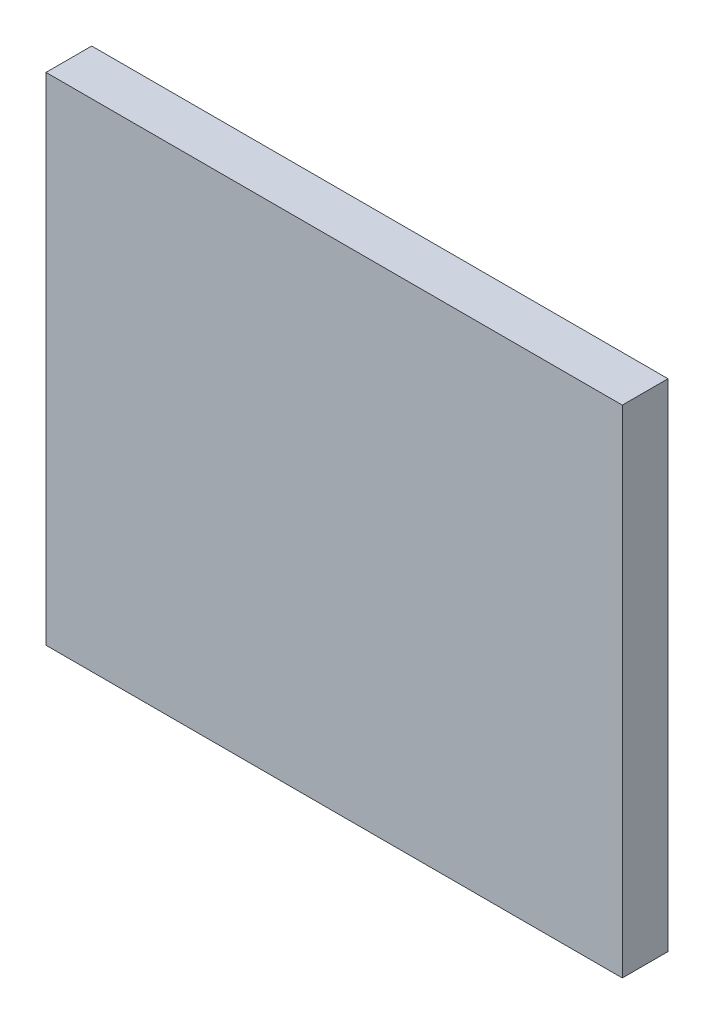
ISO-10303-21;
HEADER;
FILE_DESCRIPTION(('STEP AP214'),'2;1');
FILE_NAME('part.step','',(''),(''),'','','');
FILE_SCHEMA(('AUTOMOTIVE_DESIGN { 1 0 10303 214 1 1 1 1 }'));
ENDSEC;
DATA;
#1=APPLICATION_CONTEXT('core data for automotive mechanical design processes');
#2=APPLICATION_PROTOCOL_DEFINITION('international standard','automotive_design',2000,#1);
#3=PRODUCT_CONTEXT('',#1,'mechanical');
#4=PRODUCT('Part','Part','',(#3));
#5=PRODUCT_RELATED_PRODUCT_CATEGORY('part','',(#4));
#6=PRODUCT_DEFINITION_FORMATION('','',#4);
#7=PRODUCT_DEFINITION_CONTEXT('part definition',#1,'design');
#8=PRODUCT_DEFINITION('design','',#6,#7);
#9=PRODUCT_DEFINITION_SHAPE('','',#8);
#10=(LENGTH_UNIT() NAMED_UNIT(*) SI_UNIT(.MILLI.,.METRE.));
#11=(NAMED_UNIT(*) PLANE_ANGLE_UNIT() SI_UNIT($,.RADIAN.));
#12=(NAMED_UNIT(*) SI_UNIT($,.STERADIAN.) SOLID_ANGLE_UNIT());
#13=UNCERTAINTY_MEASURE_WITH_UNIT(LENGTH_MEASURE(1.E-05),#10,'distance_accuracy_value','');
#14=(GEOMETRIC_REPRESENTATION_CONTEXT(3) GLOBAL_UNCERTAINTY_ASSIGNED_CONTEXT((#13)) GLOBAL_UNIT_ASSIGNED_CONTEXT((#10,
#11,#12)) REPRESENTATION_CONTEXT('',''));
#15=CARTESIAN_POINT('',(0.,0.,0.));
#16=DIRECTION('',(0.,0.,1.));
#17=DIRECTION('',(1.,0.,0.));
#18=AXIS2_PLACEMENT_3D('',#15,#16,#17);
#19=CARTESIAN_POINT('',(0.,0.,44.45));
#20=DIRECTION('',(1.,0.,0.));
#21=DIRECTION('',(0.,1.,0.));
#22=AXIS2_PLACEMENT_3D('',#19,#20,#21);
#23=PLANE('',#22);
#24=DIRECTION('',(0.,-1.,0.));
#25=VECTOR('',#24,1.);
#26=CARTESIAN_POINT('',(0.,0.,0.));
#27=LINE('',#26,#25);
#28=CARTESIAN_POINT('',(0.,0.,0.));
#29=VERTEX_POINT('',#28);
#30=CARTESIAN_POINT('',(0.,-482.6,0.));
#31=VERTEX_POINT('',#30);
#32=EDGE_CURVE('E297',#29,#31,#27,.T.);
#33=ORIENTED_EDGE('',*,*,#32,.T.);
#34=DIRECTION('',(0.,0.,-1.));
#35=VECTOR('',#34,1.);
#36=CARTESIAN_POINT('',(0.,-482.6,44.45));
#37=LINE('',#36,#35);
#38=CARTESIAN_POINT('',(0.,-482.6,44.45));
#39=VERTEX_POINT('',#38);
#40=EDGE_CURVE('E11',#39,#31,#37,.T.);
#41=ORIENTED_EDGE('',*,*,#40,.F.);
#42=DIRECTION('',(0.,-1.,0.));
#43=VECTOR('',#42,1.);
#44=CARTESIAN_POINT('',(0.,0.,44.45));
#45=LINE('',#44,#43);
#46=CARTESIAN_POINT('',(0.,0.,44.45));
#47=VERTEX_POINT('',#46);
#48=EDGE_CURVE('E298',#47,#39,#45,.T.);
#49=ORIENTED_EDGE('',*,*,#48,.F.);
#50=DIRECTION('',(0.,0.,-1.));
#51=VECTOR('',#50,1.);
#52=CARTESIAN_POINT('',(0.,0.,44.45));
#53=LINE('',#52,#51);
#54=EDGE_CURVE('E308',#47,#29,#53,.T.);
#55=ORIENTED_EDGE('',*,*,#54,.T.);
#56=EDGE_LOOP('',(#33,#41,#49,#55));
#57=FACE_BOUND('',#56,.T.);
#58=ADVANCED_FACE('F32',(#57),#23,.F.);
#59=CARTESIAN_POINT('',(0.,-482.6,44.45));
#60=DIRECTION('',(0.,1.,0.));
#61=DIRECTION('',(0.,0.,1.));
#62=AXIS2_PLACEMENT_3D('',#59,#60,#61);
#63=PLANE('',#62);
#64=DIRECTION('',(1.,0.,0.));
#65=VECTOR('',#64,1.);
#66=CARTESIAN_POINT('',(0.,-482.6,0.));
#67=LINE('',#66,#65);
#68=CARTESIAN_POINT('',(560.57,-482.6,0.));
#69=VERTEX_POINT('',#68);
#70=EDGE_CURVE('E311',#31,#69,#67,.T.);
#71=ORIENTED_EDGE('',*,*,#70,.T.);
#72=DIRECTION('',(0.,0.,-1.));
#73=VECTOR('',#72,1.);
#74=CARTESIAN_POINT('',(560.57,-482.6,44.45));
#75=LINE('',#74,#73);
#76=CARTESIAN_POINT('',(560.57,-482.6,44.45));
#77=VERTEX_POINT('',#76);
#78=EDGE_CURVE('E39',#77,#69,#75,.T.);
#79=ORIENTED_EDGE('',*,*,#78,.F.);
#80=DIRECTION('',(1.,0.,0.));
#81=VECTOR('',#80,1.);
#82=CARTESIAN_POINT('',(0.,-482.6,44.45));
#83=LINE('',#82,#81);
#84=EDGE_CURVE('E301',#39,#77,#83,.T.);
#85=ORIENTED_EDGE('',*,*,#84,.F.);
#86=ORIENTED_EDGE('',*,*,#40,.T.);
#87=EDGE_LOOP('',(#71,#79,#85,#86));
#88=FACE_BOUND('',#87,.T.);
#89=ADVANCED_FACE('F341',(#88),#63,.F.);
#90=CARTESIAN_POINT('',(560.57,0.,44.45));
#91=DIRECTION('',(-1.,0.,0.));
#92=DIRECTION('',(0.,-1.,0.));
#93=AXIS2_PLACEMENT_3D('',#90,#91,#92);
#94=PLANE('',#93);
#95=DIRECTION('',(0.,1.,0.));
#96=VECTOR('',#95,1.);
#97=CARTESIAN_POINT('',(560.57,0.,0.));
#98=LINE('',#97,#96);
#99=CARTESIAN_POINT('',(560.57,0.,0.));
#100=VERTEX_POINT('',#99);
#101=EDGE_CURVE('E313',#69,#100,#98,.T.);
#102=ORIENTED_EDGE('',*,*,#101,.T.);
#103=DIRECTION('',(0.,0.,-1.));
#104=VECTOR('',#103,1.);
#105=CARTESIAN_POINT('',(560.57,0.,44.45));
#106=LINE('',#105,#104);
#107=CARTESIAN_POINT('',(560.57,0.,44.45));
#108=VERTEX_POINT('',#107);
#109=EDGE_CURVE('E318',#108,#100,#106,.T.);
#110=ORIENTED_EDGE('',*,*,#109,.F.);
#111=DIRECTION('',(0.,1.,0.));
#112=VECTOR('',#111,1.);
#113=CARTESIAN_POINT('',(560.57,0.,44.45));
#114=LINE('',#113,#112);
#115=EDGE_CURVE('E304',#77,#108,#114,.T.);
#116=ORIENTED_EDGE('',*,*,#115,.F.);
#117=ORIENTED_EDGE('',*,*,#78,.T.);
#118=EDGE_LOOP('',(#102,#110,#116,#117));
#119=FACE_BOUND('',#118,.T.);
#120=ADVANCED_FACE('F325',(#119),#94,.F.);
#121=CARTESIAN_POINT('',(0.,0.,44.45));
#122=DIRECTION('',(0.,-1.,0.));
#123=DIRECTION('',(0.,0.,-1.));
#124=AXIS2_PLACEMENT_3D('',#121,#122,#123);
#125=PLANE('',#124);
#126=DIRECTION('',(-1.,0.,0.));
#127=VECTOR('',#126,1.);
#128=CARTESIAN_POINT('',(0.,0.,0.));
#129=LINE('',#128,#127);
#130=EDGE_CURVE('E302',#100,#29,#129,.T.);
#131=ORIENTED_EDGE('',*,*,#130,.T.);
#132=ORIENTED_EDGE('',*,*,#54,.F.);
#133=DIRECTION('',(-1.,0.,0.));
#134=VECTOR('',#133,1.);
#135=CARTESIAN_POINT('',(0.,0.,44.45));
#136=LINE('',#135,#134);
#137=EDGE_CURVE('E306',#108,#47,#136,.T.);
#138=ORIENTED_EDGE('',*,*,#137,.F.);
#139=ORIENTED_EDGE('',*,*,#109,.T.);
#140=EDGE_LOOP('',(#131,#132,#138,#139));
#141=FACE_BOUND('',#140,.T.);
#142=ADVANCED_FACE('F334',(#141),#125,.F.);
#143=CARTESIAN_POINT('',(0.,0.,44.45));
#144=DIRECTION('',(0.,0.,1.));
#145=DIRECTION('',(1.,0.,0.));
#146=AXIS2_PLACEMENT_3D('',#143,#144,#145);
#147=PLANE('',#146);
#148=ORIENTED_EDGE('',*,*,#48,.T.);
#149=ORIENTED_EDGE('',*,*,#84,.T.);
#150=ORIENTED_EDGE('',*,*,#115,.T.);
#151=ORIENTED_EDGE('',*,*,#137,.T.);
#152=EDGE_LOOP('',(#148,#149,#150,#151));
#153=FACE_BOUND('',#152,.T.);
#154=ADVANCED_FACE('F340',(#153),#147,.T.);
#155=CARTESIAN_POINT('',(0.,0.,0.));
#156=DIRECTION('',(0.,0.,1.));
#157=DIRECTION('',(1.,0.,0.));
#158=AXIS2_PLACEMENT_3D('',#155,#156,#157);
#159=PLANE('',#158);
#160=DIRECTION('',(0.,1.,0.));
#161=VECTOR('',#160,1.);
#162=CARTESIAN_POINT('',(168.935,-393.7,0.));
#163=LINE('',#162,#161);
#164=CARTESIAN_POINT('',(168.935,-393.7,0.));
#165=VERTEX_POINT('',#164);
#166=CARTESIAN_POINT('',(168.935,-88.9,0.));
#167=VERTEX_POINT('',#166);
#168=EDGE_CURVE('E180',#165,#167,#163,.T.);
#169=ORIENTED_EDGE('',*,*,#168,.F.);
#170=DIRECTION('',(-1.,0.,0.));
#171=VECTOR('',#170,1.);
#172=CARTESIAN_POINT('',(168.935,-393.7,0.));
#173=LINE('',#172,#171);
#174=CARTESIAN_POINT('',(205.065,-393.7,0.));
#175=VERTEX_POINT('',#174);
#176=EDGE_CURVE('E197',#175,#165,#173,.T.);
#177=ORIENTED_EDGE('',*,*,#176,.F.);
#178=DIRECTION('',(0.,1.,0.));
#179=VECTOR('',#178,1.);
#180=CARTESIAN_POINT('',(205.065,-393.7,0.));
#181=LINE('',#180,#179);
#182=CARTESIAN_POINT('',(205.065,-88.9,0.));
#183=VERTEX_POINT('',#182);
#184=EDGE_CURVE('E205',#175,#183,#181,.T.);
#185=ORIENTED_EDGE('',*,*,#184,.T.);
#186=DIRECTION('',(-1.,0.,0.));
#187=VECTOR('',#186,1.);
#188=CARTESIAN_POINT('',(168.935,-88.9,0.));
#189=LINE('',#188,#187);
#190=EDGE_CURVE('E185',#183,#167,#189,.T.);
#191=ORIENTED_EDGE('',*,*,#190,.T.);
#192=EDGE_LOOP('',(#169,#177,#185,#191));
#193=FACE_BOUND('',#192,.T.);
#194=DIRECTION('',(0.,1.,0.));
#195=VECTOR('',#194,1.);
#196=CARTESIAN_POINT('',(75.435,-393.7,0.));
#197=LINE('',#196,#195);
#198=CARTESIAN_POINT('',(75.435,-393.7,0.));
#199=VERTEX_POINT('',#198);
#200=CARTESIAN_POINT('',(75.4349999999999,-88.9,0.));
#201=VERTEX_POINT('',#200);
#202=EDGE_CURVE('E228',#199,#201,#197,.T.);
#203=ORIENTED_EDGE('',*,*,#202,.F.);
#204=DIRECTION('',(-1.,0.,0.));
#205=VECTOR('',#204,1.);
#206=CARTESIAN_POINT('',(75.435,-393.7,0.));
#207=LINE('',#206,#205);
#208=CARTESIAN_POINT('',(111.565,-393.7,0.));
#209=VERTEX_POINT('',#208);
#210=EDGE_CURVE('E217',#209,#199,#207,.T.);
#211=ORIENTED_EDGE('',*,*,#210,.F.);
#212=DIRECTION('',(0.,1.,0.));
#213=VECTOR('',#212,1.);
#214=CARTESIAN_POINT('',(111.565,-393.7,0.));
#215=LINE('',#214,#213);
#216=CARTESIAN_POINT('',(111.565,-88.9,0.));
#217=VERTEX_POINT('',#216);
#218=EDGE_CURVE('E234',#209,#217,#215,.T.);
#219=ORIENTED_EDGE('',*,*,#218,.T.);
#220=DIRECTION('',(-1.,0.,0.));
#221=VECTOR('',#220,1.);
#222=CARTESIAN_POINT('',(75.4349999999999,-88.9,0.));
#223=LINE('',#222,#221);
#224=EDGE_CURVE('E179',#217,#201,#223,.T.);
#225=ORIENTED_EDGE('',*,*,#224,.T.);
#226=EDGE_LOOP('',(#203,#211,#219,#225));
#227=FACE_BOUND('',#226,.T.);
#228=DIRECTION('',(0.,1.,0.));
#229=VECTOR('',#228,1.);
#230=CARTESIAN_POINT('',(355.505,-393.7,0.));
#231=LINE('',#230,#229);
#232=CARTESIAN_POINT('',(355.505,-393.7,0.));
#233=VERTEX_POINT('',#232);
#234=CARTESIAN_POINT('',(355.505,-88.8999999999999,0.));
#235=VERTEX_POINT('',#234);
#236=EDGE_CURVE('E262',#233,#235,#231,.T.);
#237=ORIENTED_EDGE('',*,*,#236,.F.);
#238=DIRECTION('',(1.,0.,0.));
#239=VECTOR('',#238,1.);
#240=CARTESIAN_POINT('',(391.635,-393.7,0.));
#241=LINE('',#240,#239);
#242=CARTESIAN_POINT('',(391.635,-393.7,0.));
#243=VERTEX_POINT('',#242);
#244=EDGE_CURVE('E252',#233,#243,#241,.T.);
#245=ORIENTED_EDGE('',*,*,#244,.T.);
#246=DIRECTION('',(0.,1.,0.));
#247=VECTOR('',#246,1.);
#248=CARTESIAN_POINT('',(391.635,-393.7,0.));
#249=LINE('',#248,#247);
#250=CARTESIAN_POINT('',(391.635,-88.8999999999999,0.));
#251=VERTEX_POINT('',#250);
#252=EDGE_CURVE('E259',#243,#251,#249,.T.);
#253=ORIENTED_EDGE('',*,*,#252,.T.);
#254=DIRECTION('',(1.,0.,0.));
#255=VECTOR('',#254,1.);
#256=CARTESIAN_POINT('',(391.635,-88.8999999999999,0.));
#257=LINE('',#256,#255);
#258=EDGE_CURVE('E242',#235,#251,#257,.T.);
#259=ORIENTED_EDGE('',*,*,#258,.F.);
#260=EDGE_LOOP('',(#237,#245,#253,#259));
#261=FACE_BOUND('',#260,.T.);
#262=DIRECTION('',(0.,1.,0.));
#263=VECTOR('',#262,1.);
#264=CARTESIAN_POINT('',(449.005,-393.7,0.));
#265=LINE('',#264,#263);
#266=CARTESIAN_POINT('',(449.005,-393.7,0.));
#267=VERTEX_POINT('',#266);
#268=CARTESIAN_POINT('',(449.005,-88.8999999999999,0.));
#269=VERTEX_POINT('',#268);
#270=EDGE_CURVE('E287',#267,#269,#265,.T.);
#271=ORIENTED_EDGE('',*,*,#270,.F.);
#272=DIRECTION('',(1.,0.,0.));
#273=VECTOR('',#272,1.);
#274=CARTESIAN_POINT('',(485.135,-393.7,0.));
#275=LINE('',#274,#273);
#276=CARTESIAN_POINT('',(485.135,-393.7,0.));
#277=VERTEX_POINT('',#276);
#278=EDGE_CURVE('E278',#267,#277,#275,.T.);
#279=ORIENTED_EDGE('',*,*,#278,.T.);
#280=DIRECTION('',(0.,1.,0.));
#281=VECTOR('',#280,1.);
#282=CARTESIAN_POINT('',(485.135,-393.7,0.));
#283=LINE('',#282,#281);
#284=CARTESIAN_POINT('',(485.135,-88.8999999999999,0.));
#285=VERTEX_POINT('',#284);
#286=EDGE_CURVE('E294',#277,#285,#283,.T.);
#287=ORIENTED_EDGE('',*,*,#286,.T.);
#288=DIRECTION('',(1.,0.,0.));
#289=VECTOR('',#288,1.);
#290=CARTESIAN_POINT('',(485.135,-88.8999999999999,0.));
#291=LINE('',#290,#289);
#292=EDGE_CURVE('E267',#269,#285,#291,.T.);
#293=ORIENTED_EDGE('',*,*,#292,.F.);
#294=EDGE_LOOP('',(#271,#279,#287,#293));
#295=FACE_BOUND('',#294,.T.);
#296=ORIENTED_EDGE('',*,*,#32,.F.);
#297=ORIENTED_EDGE('',*,*,#130,.F.);
#298=ORIENTED_EDGE('',*,*,#101,.F.);
#299=ORIENTED_EDGE('',*,*,#70,.F.);
#300=EDGE_LOOP('',(#296,#297,#298,#299));
#301=FACE_BOUND('',#300,.T.);
#302=ADVANCED_FACE('F331',(#193,#227,#261,#295,#301),#159,.F.);
#303=CARTESIAN_POINT('',(485.135,-393.7,0.));
#304=DIRECTION('',(-1.,0.,0.));
#305=DIRECTION('',(0.,0.,1.));
#306=AXIS2_PLACEMENT_3D('',#303,#304,#305);
#307=PLANE('',#306);
#308=ORIENTED_EDGE('',*,*,#286,.F.);
#309=DIRECTION('',(0.,0.,1.));
#310=VECTOR('',#309,1.);
#311=CARTESIAN_POINT('',(485.135,-393.7,0.));
#312=LINE('',#311,#310);
#313=CARTESIAN_POINT('',(485.135,-393.7,10.));
#314=VERTEX_POINT('',#313);
#315=EDGE_CURVE('E281',#277,#314,#312,.T.);
#316=ORIENTED_EDGE('',*,*,#315,.T.);
#317=DIRECTION('',(0.,1.,0.));
#318=VECTOR('',#317,1.);
#319=CARTESIAN_POINT('',(485.135,-393.7,10.));
#320=LINE('',#319,#318);
#321=CARTESIAN_POINT('',(485.135,-88.8999999999999,10.));
#322=VERTEX_POINT('',#321);
#323=EDGE_CURVE('E292',#314,#322,#320,.T.);
#324=ORIENTED_EDGE('',*,*,#323,.T.);
#325=DIRECTION('',(0.,0.,1.));
#326=VECTOR('',#325,1.);
#327=CARTESIAN_POINT('',(485.135,-88.8999999999999,0.));
#328=LINE('',#327,#326);
#329=EDGE_CURVE('E270',#285,#322,#328,.T.);
#330=ORIENTED_EDGE('',*,*,#329,.F.);
#331=EDGE_LOOP('',(#308,#316,#324,#330));
#332=FACE_BOUND('',#331,.T.);
#333=ADVANCED_FACE('F353',(#332),#307,.T.);
#334=CARTESIAN_POINT('',(467.07,-393.7,3.95365594945805));
#335=DIRECTION('',(0.,1.,0.));
#336=DIRECTION('',(0.,0.,1.));
#337=AXIS2_PLACEMENT_3D('',#334,#335,#336);
#338=CYLINDRICAL_SURFACE('',#337,19.0500000361555);
#339=ORIENTED_EDGE('',*,*,#323,.F.);
#340=CARTESIAN_POINT('',(467.07,-393.7,3.95365594945805));
#341=DIRECTION('',(0.,-1.,0.));
#342=DIRECTION('',(0.,0.,-1.));
#343=AXIS2_PLACEMENT_3D('',#340,#341,#342);
#344=CIRCLE('',#343,19.0500000361555);
#345=CARTESIAN_POINT('',(449.005,-393.7,10.));
#346=VERTEX_POINT('',#345);
#347=EDGE_CURVE('E283',#314,#346,#344,.T.);
#348=ORIENTED_EDGE('',*,*,#347,.T.);
#349=DIRECTION('',(0.,1.,0.));
#350=VECTOR('',#349,1.);
#351=CARTESIAN_POINT('',(449.005,-393.7,10.));
#352=LINE('',#351,#350);
#353=CARTESIAN_POINT('',(449.005,-88.8999999999999,10.));
#354=VERTEX_POINT('',#353);
#355=EDGE_CURVE('E290',#346,#354,#352,.T.);
#356=ORIENTED_EDGE('',*,*,#355,.T.);
#357=CARTESIAN_POINT('',(467.07,-88.8999999999999,3.95365594945805));
#358=DIRECTION('',(0.,-1.,0.));
#359=DIRECTION('',(0.,0.,-1.));
#360=AXIS2_PLACEMENT_3D('',#357,#358,#359);
#361=CIRCLE('',#360,19.0500000361555);
#362=EDGE_CURVE('E273',#322,#354,#361,.T.);
#363=ORIENTED_EDGE('',*,*,#362,.F.);
#364=EDGE_LOOP('',(#339,#348,#356,#363));
#365=FACE_BOUND('',#364,.T.);
#366=ADVANCED_FACE('F359',(#365),#338,.F.);
#367=CARTESIAN_POINT('',(449.005,-393.7,0.));
#368=DIRECTION('',(1.,0.,0.));
#369=DIRECTION('',(0.,0.,-1.));
#370=AXIS2_PLACEMENT_3D('',#367,#368,#369);
#371=PLANE('',#370);
#372=ORIENTED_EDGE('',*,*,#355,.F.);
#373=DIRECTION('',(0.,0.,-1.));
#374=VECTOR('',#373,1.);
#375=CARTESIAN_POINT('',(449.005,-393.7,0.));
#376=LINE('',#375,#374);
#377=EDGE_CURVE('E285',#346,#267,#376,.T.);
#378=ORIENTED_EDGE('',*,*,#377,.T.);
#379=ORIENTED_EDGE('',*,*,#270,.T.);
#380=DIRECTION('',(0.,0.,-1.));
#381=VECTOR('',#380,1.);
#382=CARTESIAN_POINT('',(449.005,-88.8999999999999,0.));
#383=LINE('',#382,#381);
#384=EDGE_CURVE('E276',#354,#269,#383,.T.);
#385=ORIENTED_EDGE('',*,*,#384,.F.);
#386=EDGE_LOOP('',(#372,#378,#379,#385));
#387=FACE_BOUND('',#386,.T.);
#388=ADVANCED_FACE('F363',(#387),#371,.T.);
#389=CARTESIAN_POINT('',(467.07,-393.7,3.95365594945805));
#390=DIRECTION('',(0.,-1.,0.));
#391=DIRECTION('',(0.,0.,-1.));
#392=AXIS2_PLACEMENT_3D('',#389,#390,#391);
#393=PLANE('',#392);
#394=ORIENTED_EDGE('',*,*,#278,.F.);
#395=ORIENTED_EDGE('',*,*,#377,.F.);
#396=ORIENTED_EDGE('',*,*,#347,.F.);
#397=ORIENTED_EDGE('',*,*,#315,.F.);
#398=EDGE_LOOP('',(#394,#395,#396,#397));
#399=FACE_BOUND('',#398,.T.);
#400=ADVANCED_FACE('F367',(#399),#393,.F.);
#401=CARTESIAN_POINT('',(467.07,-88.8999999999999,3.95365594945805));
#402=DIRECTION('',(0.,-1.,0.));
#403=DIRECTION('',(0.,0.,-1.));
#404=AXIS2_PLACEMENT_3D('',#401,#402,#403);
#405=PLANE('',#404);
#406=ORIENTED_EDGE('',*,*,#292,.T.);
#407=ORIENTED_EDGE('',*,*,#329,.T.);
#408=ORIENTED_EDGE('',*,*,#362,.T.);
#409=ORIENTED_EDGE('',*,*,#384,.T.);
#410=EDGE_LOOP('',(#406,#407,#408,#409));
#411=FACE_BOUND('',#410,.T.);
#412=ADVANCED_FACE('F371',(#411),#405,.T.);
#413=CARTESIAN_POINT('',(373.57,-393.7,3.95365594945806));
#414=DIRECTION('',(0.,1.,0.));
#415=DIRECTION('',(0.,0.,1.));
#416=AXIS2_PLACEMENT_3D('',#413,#414,#415);
#417=CYLINDRICAL_SURFACE('',#416,19.0500000361555);
#418=DIRECTION('',(0.,1.,0.));
#419=VECTOR('',#418,1.);
#420=CARTESIAN_POINT('',(391.635,-393.7,10.));
#421=LINE('',#420,#419);
#422=CARTESIAN_POINT('',(391.635,-393.7,10.));
#423=VERTEX_POINT('',#422);
#424=CARTESIAN_POINT('',(391.635,-88.8999999999999,10.));
#425=VERTEX_POINT('',#424);
#426=EDGE_CURVE('E257',#423,#425,#421,.T.);
#427=ORIENTED_EDGE('',*,*,#426,.F.);
#428=CARTESIAN_POINT('',(373.57,-393.7,3.95365594945806));
#429=DIRECTION('',(0.,-1.,0.));
#430=DIRECTION('',(0.,0.,-1.));
#431=AXIS2_PLACEMENT_3D('',#428,#429,#430);
#432=CIRCLE('',#431,19.0500000361555);
#433=CARTESIAN_POINT('',(355.505,-393.7,9.99999999999999));
#434=VERTEX_POINT('',#433);
#435=EDGE_CURVE('E247',#423,#434,#432,.T.);
#436=ORIENTED_EDGE('',*,*,#435,.T.);
#437=DIRECTION('',(0.,1.,0.));
#438=VECTOR('',#437,1.);
#439=CARTESIAN_POINT('',(355.505,-393.7,9.99999999999999));
#440=LINE('',#439,#438);
#441=CARTESIAN_POINT('',(355.505,-88.8999999999999,9.99999999999999));
#442=VERTEX_POINT('',#441);
#443=EDGE_CURVE('E265',#434,#442,#440,.T.);
#444=ORIENTED_EDGE('',*,*,#443,.T.);
#445=CARTESIAN_POINT('',(373.57,-88.8999999999999,3.95365594945806));
#446=DIRECTION('',(0.,-1.,0.));
#447=DIRECTION('',(0.,0.,-1.));
#448=AXIS2_PLACEMENT_3D('',#445,#446,#447);
#449=CIRCLE('',#448,19.0500000361555);
#450=EDGE_CURVE('E237',#425,#442,#449,.T.);
#451=ORIENTED_EDGE('',*,*,#450,.F.);
#452=EDGE_LOOP('',(#427,#436,#444,#451));
#453=FACE_BOUND('',#452,.T.);
#454=ADVANCED_FACE('F375',(#453),#417,.F.);
#455=CARTESIAN_POINT('',(355.505,-393.7,0.));
#456=DIRECTION('',(1.,0.,0.));
#457=DIRECTION('',(0.,0.,-1.));
#458=AXIS2_PLACEMENT_3D('',#455,#456,#457);
#459=PLANE('',#458);
#460=ORIENTED_EDGE('',*,*,#443,.F.);
#461=DIRECTION('',(0.,0.,-1.));
#462=VECTOR('',#461,1.);
#463=CARTESIAN_POINT('',(355.505,-393.7,0.));
#464=LINE('',#463,#462);
#465=EDGE_CURVE('E250',#434,#233,#464,.T.);
#466=ORIENTED_EDGE('',*,*,#465,.T.);
#467=ORIENTED_EDGE('',*,*,#236,.T.);
#468=DIRECTION('',(0.,0.,-1.));
#469=VECTOR('',#468,1.);
#470=CARTESIAN_POINT('',(355.505,-88.8999999999999,0.));
#471=LINE('',#470,#469);
#472=EDGE_CURVE('E240',#442,#235,#471,.T.);
#473=ORIENTED_EDGE('',*,*,#472,.F.);
#474=EDGE_LOOP('',(#460,#466,#467,#473));
#475=FACE_BOUND('',#474,.T.);
#476=ADVANCED_FACE('F379',(#475),#459,.T.);
#477=CARTESIAN_POINT('',(391.635,-393.7,10.));
#478=DIRECTION('',(-1.,0.,0.));
#479=DIRECTION('',(0.,0.,1.));
#480=AXIS2_PLACEMENT_3D('',#477,#478,#479);
#481=PLANE('',#480);
#482=ORIENTED_EDGE('',*,*,#252,.F.);
#483=DIRECTION('',(0.,0.,1.));
#484=VECTOR('',#483,1.);
#485=CARTESIAN_POINT('',(391.635,-393.7,10.));
#486=LINE('',#485,#484);
#487=EDGE_CURVE('E255',#243,#423,#486,.T.);
#488=ORIENTED_EDGE('',*,*,#487,.T.);
#489=ORIENTED_EDGE('',*,*,#426,.T.);
#490=DIRECTION('',(0.,0.,1.));
#491=VECTOR('',#490,1.);
#492=CARTESIAN_POINT('',(391.635,-88.8999999999999,10.));
#493=LINE('',#492,#491);
#494=EDGE_CURVE('E244',#251,#425,#493,.T.);
#495=ORIENTED_EDGE('',*,*,#494,.F.);
#496=EDGE_LOOP('',(#482,#488,#489,#495));
#497=FACE_BOUND('',#496,.T.);
#498=ADVANCED_FACE('F383',(#497),#481,.T.);
#499=CARTESIAN_POINT('',(373.57,-393.7,3.95365594945806));
#500=DIRECTION('',(0.,-1.,0.));
#501=DIRECTION('',(0.,0.,-1.));
#502=AXIS2_PLACEMENT_3D('',#499,#500,#501);
#503=PLANE('',#502);
#504=ORIENTED_EDGE('',*,*,#435,.F.);
#505=ORIENTED_EDGE('',*,*,#487,.F.);
#506=ORIENTED_EDGE('',*,*,#244,.F.);
#507=ORIENTED_EDGE('',*,*,#465,.F.);
#508=EDGE_LOOP('',(#504,#505,#506,#507));
#509=FACE_BOUND('',#508,.T.);
#510=ADVANCED_FACE('F387',(#509),#503,.F.);
#511=CARTESIAN_POINT('',(373.57,-88.8999999999999,3.95365594945806));
#512=DIRECTION('',(0.,-1.,0.));
#513=DIRECTION('',(0.,0.,-1.));
#514=AXIS2_PLACEMENT_3D('',#511,#512,#513);
#515=PLANE('',#514);
#516=ORIENTED_EDGE('',*,*,#450,.T.);
#517=ORIENTED_EDGE('',*,*,#472,.T.);
#518=ORIENTED_EDGE('',*,*,#258,.T.);
#519=ORIENTED_EDGE('',*,*,#494,.T.);
#520=EDGE_LOOP('',(#516,#517,#518,#519));
#521=FACE_BOUND('',#520,.T.);
#522=ADVANCED_FACE('F391',(#521),#515,.T.);
#523=CARTESIAN_POINT('',(111.565,-393.7,0.));
#524=DIRECTION('',(1.,0.,0.));
#525=DIRECTION('',(0.,1.,0.));
#526=AXIS2_PLACEMENT_3D('',#523,#524,#525);
#527=PLANE('',#526);
#528=ORIENTED_EDGE('',*,*,#218,.F.);
#529=DIRECTION('',(0.,0.,-1.));
#530=VECTOR('',#529,1.);
#531=CARTESIAN_POINT('',(111.565,-393.7,0.));
#532=LINE('',#531,#530);
#533=CARTESIAN_POINT('',(111.565,-393.7,10.));
#534=VERTEX_POINT('',#533);
#535=EDGE_CURVE('E219',#534,#209,#532,.T.);
#536=ORIENTED_EDGE('',*,*,#535,.F.);
#537=DIRECTION('',(0.,1.,0.));
#538=VECTOR('',#537,1.);
#539=CARTESIAN_POINT('',(111.565,-393.7,10.));
#540=LINE('',#539,#538);
#541=CARTESIAN_POINT('',(111.565,-88.9,10.));
#542=VERTEX_POINT('',#541);
#543=EDGE_CURVE('E232',#534,#542,#540,.T.);
#544=ORIENTED_EDGE('',*,*,#543,.T.);
#545=DIRECTION('',(0.,0.,-1.));
#546=VECTOR('',#545,1.);
#547=CARTESIAN_POINT('',(111.565,-88.9,0.));
#548=LINE('',#547,#546);
#549=EDGE_CURVE('E211',#542,#217,#548,.T.);
#550=ORIENTED_EDGE('',*,*,#549,.T.);
#551=EDGE_LOOP('',(#528,#536,#544,#550));
#552=FACE_BOUND('',#551,.T.);
#553=ADVANCED_FACE('F395',(#552),#527,.F.);
#554=CARTESIAN_POINT('',(93.5,-393.7,3.95365594945805));
#555=DIRECTION('',(0.,1.,0.));
#556=DIRECTION('',(-1.,0.,0.));
#557=AXIS2_PLACEMENT_3D('',#554,#555,#556);
#558=CYLINDRICAL_SURFACE('',#557,19.0500000361555);
#559=ORIENTED_EDGE('',*,*,#543,.F.);
#560=CARTESIAN_POINT('',(93.5,-393.7,3.95365594945805));
#561=DIRECTION('',(0.,1.,0.));
#562=DIRECTION('',(0.,0.,-1.));
#563=AXIS2_PLACEMENT_3D('',#560,#561,#562);
#564=CIRCLE('',#563,19.0500000361555);
#565=CARTESIAN_POINT('',(75.435,-393.7,10.));
#566=VERTEX_POINT('',#565);
#567=EDGE_CURVE('E222',#566,#534,#564,.T.);
#568=ORIENTED_EDGE('',*,*,#567,.F.);
#569=DIRECTION('',(0.,1.,0.));
#570=VECTOR('',#569,1.);
#571=CARTESIAN_POINT('',(75.435,-393.7,10.));
#572=LINE('',#571,#570);
#573=CARTESIAN_POINT('',(75.4349999999999,-88.9,10.));
#574=VERTEX_POINT('',#573);
#575=EDGE_CURVE('E230',#566,#574,#572,.T.);
#576=ORIENTED_EDGE('',*,*,#575,.T.);
#577=CARTESIAN_POINT('',(93.4999999999999,-88.9,3.95365594945805));
#578=DIRECTION('',(0.,1.,0.));
#579=DIRECTION('',(0.,0.,-1.));
#580=AXIS2_PLACEMENT_3D('',#577,#578,#579);
#581=CIRCLE('',#580,19.0500000361555);
#582=EDGE_CURVE('E213',#574,#542,#581,.T.);
#583=ORIENTED_EDGE('',*,*,#582,.T.);
#584=EDGE_LOOP('',(#559,#568,#576,#583));
#585=FACE_BOUND('',#584,.T.);
#586=ADVANCED_FACE('F399',(#585),#558,.F.);
#587=CARTESIAN_POINT('',(75.435,-393.7,0.));
#588=DIRECTION('',(-1.,0.,0.));
#589=DIRECTION('',(0.,-1.,0.));
#590=AXIS2_PLACEMENT_3D('',#587,#588,#589);
#591=PLANE('',#590);
#592=ORIENTED_EDGE('',*,*,#575,.F.);
#593=DIRECTION('',(0.,0.,1.));
#594=VECTOR('',#593,1.);
#595=CARTESIAN_POINT('',(75.435,-393.7,0.));
#596=LINE('',#595,#594);
#597=EDGE_CURVE('E225',#199,#566,#596,.T.);
#598=ORIENTED_EDGE('',*,*,#597,.F.);
#599=ORIENTED_EDGE('',*,*,#202,.T.);
#600=DIRECTION('',(0.,0.,1.));
#601=VECTOR('',#600,1.);
#602=CARTESIAN_POINT('',(75.4349999999999,-88.9,0.));
#603=LINE('',#602,#601);
#604=EDGE_CURVE('E54',#201,#574,#603,.T.);
#605=ORIENTED_EDGE('',*,*,#604,.T.);
#606=EDGE_LOOP('',(#592,#598,#599,#605));
#607=FACE_BOUND('',#606,.T.);
#608=ADVANCED_FACE('F403',(#607),#591,.F.);
#609=CARTESIAN_POINT('',(93.5,-393.7,3.95365594945805));
#610=DIRECTION('',(0.,-1.,0.));
#611=DIRECTION('',(0.,0.,-1.));
#612=AXIS2_PLACEMENT_3D('',#609,#610,#611);
#613=PLANE('',#612);
#614=ORIENTED_EDGE('',*,*,#210,.T.);
#615=ORIENTED_EDGE('',*,*,#597,.T.);
#616=ORIENTED_EDGE('',*,*,#567,.T.);
#617=ORIENTED_EDGE('',*,*,#535,.T.);
#618=EDGE_LOOP('',(#614,#615,#616,#617));
#619=FACE_BOUND('',#618,.T.);
#620=ADVANCED_FACE('F407',(#619),#613,.F.);
#621=CARTESIAN_POINT('',(93.4999999999999,-88.9,3.95365594945805));
#622=DIRECTION('',(0.,-1.,0.));
#623=DIRECTION('',(0.,0.,-1.));
#624=AXIS2_PLACEMENT_3D('',#621,#622,#623);
#625=PLANE('',#624);
#626=ORIENTED_EDGE('',*,*,#224,.F.);
#627=ORIENTED_EDGE('',*,*,#549,.F.);
#628=ORIENTED_EDGE('',*,*,#582,.F.);
#629=ORIENTED_EDGE('',*,*,#604,.F.);
#630=EDGE_LOOP('',(#626,#627,#628,#629));
#631=FACE_BOUND('',#630,.T.);
#632=ADVANCED_FACE('F411',(#631),#625,.T.);
#633=CARTESIAN_POINT('',(187.,-393.7,3.95365594945806));
#634=DIRECTION('',(0.,1.,0.));
#635=DIRECTION('',(-1.,0.,0.));
#636=AXIS2_PLACEMENT_3D('',#633,#634,#635);
#637=CYLINDRICAL_SURFACE('',#636,19.0500000361555);
#638=DIRECTION('',(0.,1.,0.));
#639=VECTOR('',#638,1.);
#640=CARTESIAN_POINT('',(205.065,-393.7,9.99999999999999));
#641=LINE('',#640,#639);
#642=CARTESIAN_POINT('',(205.065,-393.7,9.99999999999999));
#643=VERTEX_POINT('',#642);
#644=CARTESIAN_POINT('',(205.065,-88.9,9.99999999999999));
#645=VERTEX_POINT('',#644);
#646=EDGE_CURVE('E203',#643,#645,#641,.T.);
#647=ORIENTED_EDGE('',*,*,#646,.F.);
#648=CARTESIAN_POINT('',(187.,-393.7,3.95365594945806));
#649=DIRECTION('',(0.,1.,0.));
#650=DIRECTION('',(0.,0.,-1.));
#651=AXIS2_PLACEMENT_3D('',#648,#649,#650);
#652=CIRCLE('',#651,19.0500000361555);
#653=CARTESIAN_POINT('',(168.935,-393.7,10.));
#654=VERTEX_POINT('',#653);
#655=EDGE_CURVE('E176',#654,#643,#652,.T.);
#656=ORIENTED_EDGE('',*,*,#655,.F.);
#657=DIRECTION('',(0.,1.,0.));
#658=VECTOR('',#657,1.);
#659=CARTESIAN_POINT('',(168.935,-393.7,10.));
#660=LINE('',#659,#658);
#661=CARTESIAN_POINT('',(168.935,-88.9,10.));
#662=VERTEX_POINT('',#661);
#663=EDGE_CURVE('E172',#654,#662,#660,.T.);
#664=ORIENTED_EDGE('',*,*,#663,.T.);
#665=CARTESIAN_POINT('',(187.,-88.9,3.95365594945806));
#666=DIRECTION('',(0.,1.,0.));
#667=DIRECTION('',(0.,0.,-1.));
#668=AXIS2_PLACEMENT_3D('',#665,#666,#667);
#669=CIRCLE('',#668,19.0500000361555);
#670=EDGE_CURVE('E174',#662,#645,#669,.T.);
#671=ORIENTED_EDGE('',*,*,#670,.T.);
#672=EDGE_LOOP('',(#647,#656,#664,#671));
#673=FACE_BOUND('',#672,.T.);
#674=ADVANCED_FACE('F173',(#673),#637,.F.);
#675=CARTESIAN_POINT('',(168.935,-393.7,10.));
#676=DIRECTION('',(-1.,0.,0.));
#677=DIRECTION('',(0.,-1.,0.));
#678=AXIS2_PLACEMENT_3D('',#675,#676,#677);
#679=PLANE('',#678);
#680=ORIENTED_EDGE('',*,*,#663,.F.);
#681=DIRECTION('',(0.,0.,1.));
#682=VECTOR('',#681,1.);
#683=CARTESIAN_POINT('',(168.935,-393.7,10.));
#684=LINE('',#683,#682);
#685=EDGE_CURVE('E195',#165,#654,#684,.T.);
#686=ORIENTED_EDGE('',*,*,#685,.F.);
#687=ORIENTED_EDGE('',*,*,#168,.T.);
#688=DIRECTION('',(0.,0.,1.));
#689=VECTOR('',#688,1.);
#690=CARTESIAN_POINT('',(168.935,-88.9,10.));
#691=LINE('',#690,#689);
#692=EDGE_CURVE('E46',#167,#662,#691,.T.);
#693=ORIENTED_EDGE('',*,*,#692,.T.);
#694=EDGE_LOOP('',(#680,#686,#687,#693));
#695=FACE_BOUND('',#694,.T.);
#696=ADVANCED_FACE('F182',(#695),#679,.F.);
#697=CARTESIAN_POINT('',(205.065,-393.7,0.));
#698=DIRECTION('',(1.,0.,0.));
#699=DIRECTION('',(0.,1.,0.));
#700=AXIS2_PLACEMENT_3D('',#697,#698,#699);
#701=PLANE('',#700);
#702=ORIENTED_EDGE('',*,*,#184,.F.);
#703=DIRECTION('',(0.,0.,-1.));
#704=VECTOR('',#703,1.);
#705=CARTESIAN_POINT('',(205.065,-393.7,0.));
#706=LINE('',#705,#704);
#707=EDGE_CURVE('E200',#643,#175,#706,.T.);
#708=ORIENTED_EDGE('',*,*,#707,.F.);
#709=ORIENTED_EDGE('',*,*,#646,.T.);
#710=DIRECTION('',(0.,0.,-1.));
#711=VECTOR('',#710,1.);
#712=CARTESIAN_POINT('',(205.065,-88.9,0.));
#713=LINE('',#712,#711);
#714=EDGE_CURVE('E189',#645,#183,#713,.T.);
#715=ORIENTED_EDGE('',*,*,#714,.T.);
#716=EDGE_LOOP('',(#702,#708,#709,#715));
#717=FACE_BOUND('',#716,.T.);
#718=ADVANCED_FACE('F419',(#717),#701,.F.);
#719=CARTESIAN_POINT('',(187.,-393.7,3.95365594945806));
#720=DIRECTION('',(0.,-1.,0.));
#721=DIRECTION('',(0.,0.,-1.));
#722=AXIS2_PLACEMENT_3D('',#719,#720,#721);
#723=PLANE('',#722);
#724=ORIENTED_EDGE('',*,*,#655,.T.);
#725=ORIENTED_EDGE('',*,*,#707,.T.);
#726=ORIENTED_EDGE('',*,*,#176,.T.);
#727=ORIENTED_EDGE('',*,*,#685,.T.);
#728=EDGE_LOOP('',(#724,#725,#726,#727));
#729=FACE_BOUND('',#728,.T.);
#730=ADVANCED_FACE('F422',(#729),#723,.F.);
#731=CARTESIAN_POINT('',(187.,-88.9,3.95365594945806));
#732=DIRECTION('',(0.,-1.,0.));
#733=DIRECTION('',(0.,0.,-1.));
#734=AXIS2_PLACEMENT_3D('',#731,#732,#733);
#735=PLANE('',#734);
#736=ORIENTED_EDGE('',*,*,#670,.F.);
#737=ORIENTED_EDGE('',*,*,#692,.F.);
#738=ORIENTED_EDGE('',*,*,#190,.F.);
#739=ORIENTED_EDGE('',*,*,#714,.F.);
#740=EDGE_LOOP('',(#736,#737,#738,#739));
#741=FACE_BOUND('',#740,.T.);
#742=ADVANCED_FACE('F188',(#741),#735,.T.);
#743=CLOSED_SHELL('',(#58,#89,#120,#142,#154,#302,#333,#366,#388,#400,#412,#454,#476,#498,#510,
#522,#553,#586,#608,#620,#632,#674,#696,#718,#730,#742));
#744=MANIFOLD_SOLID_BREP('B2',#743);
#745=ADVANCED_BREP_SHAPE_REPRESENTATION('',(#18,#744),#14);
#746=SHAPE_DEFINITION_REPRESENTATION(#9,#745);
ENDSEC;
END-ISO-10303-21;
